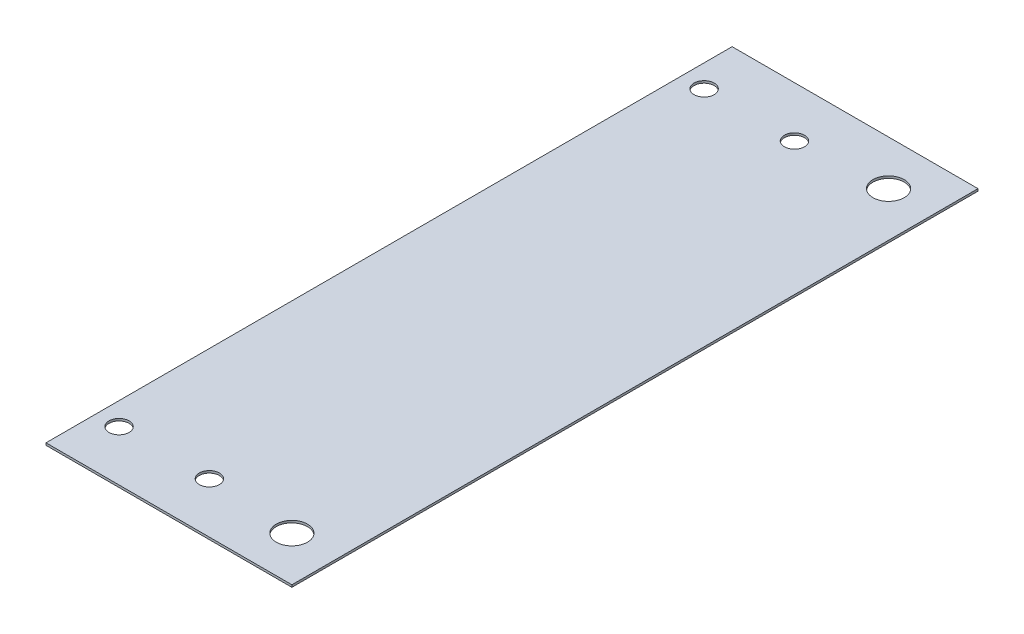
ISO-10303-21;
HEADER;
FILE_DESCRIPTION(('STEP AP214'),'2;1');
FILE_NAME('part.step','',(''),(''),'','','');
FILE_SCHEMA(('AUTOMOTIVE_DESIGN { 1 0 10303 214 1 1 1 1 }'));
ENDSEC;
DATA;
#1=APPLICATION_CONTEXT('core data for automotive mechanical design processes');
#2=APPLICATION_PROTOCOL_DEFINITION('international standard','automotive_design',2000,#1);
#3=PRODUCT_CONTEXT('',#1,'mechanical');
#4=PRODUCT('Part','Part','',(#3));
#5=PRODUCT_RELATED_PRODUCT_CATEGORY('part','',(#4));
#6=PRODUCT_DEFINITION_FORMATION('','',#4);
#7=PRODUCT_DEFINITION_CONTEXT('part definition',#1,'design');
#8=PRODUCT_DEFINITION('design','',#6,#7);
#9=PRODUCT_DEFINITION_SHAPE('','',#8);
#10=(LENGTH_UNIT() NAMED_UNIT(*) SI_UNIT(.MILLI.,.METRE.));
#11=(NAMED_UNIT(*) PLANE_ANGLE_UNIT() SI_UNIT($,.RADIAN.));
#12=(NAMED_UNIT(*) SI_UNIT($,.STERADIAN.) SOLID_ANGLE_UNIT());
#13=UNCERTAINTY_MEASURE_WITH_UNIT(LENGTH_MEASURE(1.E-05),#10,'distance_accuracy_value','');
#14=(GEOMETRIC_REPRESENTATION_CONTEXT(3) GLOBAL_UNCERTAINTY_ASSIGNED_CONTEXT((#13)) GLOBAL_UNIT_ASSIGNED_CONTEXT((#10,
#11,#12)) REPRESENTATION_CONTEXT('',''));
#15=CARTESIAN_POINT('',(0.,0.,0.));
#16=DIRECTION('',(0.,0.,1.));
#17=DIRECTION('',(1.,0.,0.));
#18=AXIS2_PLACEMENT_3D('',#15,#16,#17);
#19=CARTESIAN_POINT('',(13.75,0.25,38.3675));
#20=DIRECTION('',(0.,1.,0.));
#21=DIRECTION('',(0.,0.,1.));
#22=AXIS2_PLACEMENT_3D('',#19,#20,#21);
#23=PLANE('',#22);
#24=CARTESIAN_POINT('',(-11.23,0.25,32.7175));
#25=DIRECTION('',(0.,1.,0.));
#26=DIRECTION('',(0.,0.,1.));
#27=AXIS2_PLACEMENT_3D('',#24,#25,#26);
#28=CIRCLE('',#27,1.125);
#29=CARTESIAN_POINT('',(-11.23,0.25,33.8425));
#30=VERTEX_POINT('',#29);
#31=EDGE_CURVE('E133',#30,#30,#28,.T.);
#32=ORIENTED_EDGE('',*,*,#31,.F.);
#33=EDGE_LOOP('',(#32));
#34=FACE_BOUND('',#33,.T.);
#35=CARTESIAN_POINT('',(8.74999999999998,0.25,-33.3675));
#36=DIRECTION('',(0.,1.,0.));
#37=DIRECTION('',(0.,0.,1.));
#38=AXIS2_PLACEMENT_3D('',#35,#36,#37);
#39=CIRCLE('',#38,1.75);
#40=CARTESIAN_POINT('',(8.74999999999998,0.25,-31.6175));
#41=VERTEX_POINT('',#40);
#42=EDGE_CURVE('E121',#41,#41,#39,.T.);
#43=ORIENTED_EDGE('',*,*,#42,.F.);
#44=EDGE_LOOP('',(#43));
#45=FACE_BOUND('',#44,.T.);
#46=CARTESIAN_POINT('',(-11.23,0.25,-32.7175));
#47=DIRECTION('',(0.,1.,0.));
#48=DIRECTION('',(0.,0.,1.));
#49=AXIS2_PLACEMENT_3D('',#46,#47,#48);
#50=CIRCLE('',#49,1.125);
#51=CARTESIAN_POINT('',(-11.23,0.25,-31.5925));
#52=VERTEX_POINT('',#51);
#53=EDGE_CURVE('E100',#52,#52,#50,.T.);
#54=ORIENTED_EDGE('',*,*,#53,.F.);
#55=EDGE_LOOP('',(#54));
#56=FACE_BOUND('',#55,.T.);
#57=DIRECTION('',(0.,0.,-1.));
#58=VECTOR('',#57,1.);
#59=CARTESIAN_POINT('',(13.75,0.25,-38.3675));
#60=LINE('',#59,#58);
#61=CARTESIAN_POINT('',(13.75,0.25,38.3675));
#62=VERTEX_POINT('',#61);
#63=CARTESIAN_POINT('',(13.75,0.25,-38.3675));
#64=VERTEX_POINT('',#63);
#65=EDGE_CURVE('E85',#62,#64,#60,.T.);
#66=ORIENTED_EDGE('',*,*,#65,.T.);
#67=DIRECTION('',(-1.,0.,0.));
#68=VECTOR('',#67,1.);
#69=CARTESIAN_POINT('',(-13.75,0.25,-38.3675));
#70=LINE('',#69,#68);
#71=CARTESIAN_POINT('',(-13.75,0.25,-38.3675));
#72=VERTEX_POINT('',#71);
#73=EDGE_CURVE('E80',#64,#72,#70,.T.);
#74=ORIENTED_EDGE('',*,*,#73,.T.);
#75=DIRECTION('',(0.,0.,1.));
#76=VECTOR('',#75,1.);
#77=CARTESIAN_POINT('',(-13.75,0.25,-38.3675));
#78=LINE('',#77,#76);
#79=CARTESIAN_POINT('',(-13.75,0.25,38.3675));
#80=VERTEX_POINT('',#79);
#81=EDGE_CURVE('E83',#72,#80,#78,.T.);
#82=ORIENTED_EDGE('',*,*,#81,.T.);
#83=DIRECTION('',(1.,0.,0.));
#84=VECTOR('',#83,1.);
#85=CARTESIAN_POINT('',(-13.75,0.25,38.3675));
#86=LINE('',#85,#84);
#87=EDGE_CURVE('E50',#80,#62,#86,.T.);
#88=ORIENTED_EDGE('',*,*,#87,.T.);
#89=EDGE_LOOP('',(#66,#74,#82,#88));
#90=FACE_BOUND('',#89,.T.);
#91=CARTESIAN_POINT('',(-1.13000000000003,0.25,-32.7175));
#92=DIRECTION('',(0.,1.,0.));
#93=DIRECTION('',(0.,0.,1.));
#94=AXIS2_PLACEMENT_3D('',#91,#92,#93);
#95=CIRCLE('',#94,1.125);
#96=CARTESIAN_POINT('',(-1.13000000000003,0.25,-31.5925));
#97=VERTEX_POINT('',#96);
#98=EDGE_CURVE('E115',#97,#97,#95,.T.);
#99=ORIENTED_EDGE('',*,*,#98,.F.);
#100=EDGE_LOOP('',(#99));
#101=FACE_BOUND('',#100,.T.);
#102=CARTESIAN_POINT('',(8.74999999999997,0.25,33.3675));
#103=DIRECTION('',(0.,1.,0.));
#104=DIRECTION('',(0.,0.,1.));
#105=AXIS2_PLACEMENT_3D('',#102,#103,#104);
#106=CIRCLE('',#105,1.75);
#107=CARTESIAN_POINT('',(8.74999999999997,0.25,35.1175));
#108=VERTEX_POINT('',#107);
#109=EDGE_CURVE('E127',#108,#108,#106,.T.);
#110=ORIENTED_EDGE('',*,*,#109,.F.);
#111=EDGE_LOOP('',(#110));
#112=FACE_BOUND('',#111,.T.);
#113=CARTESIAN_POINT('',(-1.13000000000003,0.25,32.7175));
#114=DIRECTION('',(0.,1.,0.));
#115=DIRECTION('',(0.,0.,1.));
#116=AXIS2_PLACEMENT_3D('',#113,#114,#115);
#117=CIRCLE('',#116,1.125);
#118=CARTESIAN_POINT('',(-1.13000000000003,0.25,33.8425));
#119=VERTEX_POINT('',#118);
#120=EDGE_CURVE('E139',#119,#119,#117,.T.);
#121=ORIENTED_EDGE('',*,*,#120,.F.);
#122=EDGE_LOOP('',(#121));
#123=FACE_BOUND('',#122,.T.);
#124=ADVANCED_FACE('F33',(#34,#45,#56,#90,#101,#112,#123),#23,.T.);
#125=CARTESIAN_POINT('',(13.75,0.,38.3675));
#126=DIRECTION('',(0.,1.,0.));
#127=DIRECTION('',(0.,0.,1.));
#128=AXIS2_PLACEMENT_3D('',#125,#126,#127);
#129=PLANE('',#128);
#130=CARTESIAN_POINT('',(-11.23,0.,32.7175));
#131=DIRECTION('',(0.,1.,0.));
#132=DIRECTION('',(0.,0.,1.));
#133=AXIS2_PLACEMENT_3D('',#130,#131,#132);
#134=CIRCLE('',#133,1.125);
#135=CARTESIAN_POINT('',(-11.23,0.,33.8425));
#136=VERTEX_POINT('',#135);
#137=EDGE_CURVE('E136',#136,#136,#134,.T.);
#138=ORIENTED_EDGE('',*,*,#137,.T.);
#139=EDGE_LOOP('',(#138));
#140=FACE_BOUND('',#139,.T.);
#141=CARTESIAN_POINT('',(8.74999999999998,0.,-33.3675));
#142=DIRECTION('',(0.,1.,0.));
#143=DIRECTION('',(0.,0.,1.));
#144=AXIS2_PLACEMENT_3D('',#141,#142,#143);
#145=CIRCLE('',#144,1.75);
#146=CARTESIAN_POINT('',(8.74999999999998,0.,-31.6175));
#147=VERTEX_POINT('',#146);
#148=EDGE_CURVE('E124',#147,#147,#145,.T.);
#149=ORIENTED_EDGE('',*,*,#148,.T.);
#150=EDGE_LOOP('',(#149));
#151=FACE_BOUND('',#150,.T.);
#152=CARTESIAN_POINT('',(-11.23,0.,-32.7175));
#153=DIRECTION('',(0.,1.,0.));
#154=DIRECTION('',(0.,0.,1.));
#155=AXIS2_PLACEMENT_3D('',#152,#153,#154);
#156=CIRCLE('',#155,1.125);
#157=CARTESIAN_POINT('',(-11.23,0.,-31.5925));
#158=VERTEX_POINT('',#157);
#159=EDGE_CURVE('E112',#158,#158,#156,.T.);
#160=ORIENTED_EDGE('',*,*,#159,.T.);
#161=EDGE_LOOP('',(#160));
#162=FACE_BOUND('',#161,.T.);
#163=DIRECTION('',(0.,0.,-1.));
#164=VECTOR('',#163,1.);
#165=CARTESIAN_POINT('',(13.75,0.,-38.3675));
#166=LINE('',#165,#164);
#167=CARTESIAN_POINT('',(13.75,0.,38.3675));
#168=VERTEX_POINT('',#167);
#169=CARTESIAN_POINT('',(13.75,0.,-38.3675));
#170=VERTEX_POINT('',#169);
#171=EDGE_CURVE('E97',#168,#170,#166,.T.);
#172=ORIENTED_EDGE('',*,*,#171,.F.);
#173=DIRECTION('',(1.,0.,0.));
#174=VECTOR('',#173,1.);
#175=CARTESIAN_POINT('',(-13.75,0.,38.3675));
#176=LINE('',#175,#174);
#177=CARTESIAN_POINT('',(-13.75,0.,38.3675));
#178=VERTEX_POINT('',#177);
#179=EDGE_CURVE('E73',#178,#168,#176,.T.);
#180=ORIENTED_EDGE('',*,*,#179,.F.);
#181=DIRECTION('',(0.,0.,1.));
#182=VECTOR('',#181,1.);
#183=CARTESIAN_POINT('',(-13.75,0.,-38.3675));
#184=LINE('',#183,#182);
#185=CARTESIAN_POINT('',(-13.75,0.,-38.3675));
#186=VERTEX_POINT('',#185);
#187=EDGE_CURVE('E67',#186,#178,#184,.T.);
#188=ORIENTED_EDGE('',*,*,#187,.F.);
#189=DIRECTION('',(-1.,0.,0.));
#190=VECTOR('',#189,1.);
#191=CARTESIAN_POINT('',(-13.75,0.,-38.3675));
#192=LINE('',#191,#190);
#193=EDGE_CURVE('E89',#170,#186,#192,.T.);
#194=ORIENTED_EDGE('',*,*,#193,.F.);
#195=EDGE_LOOP('',(#172,#180,#188,#194));
#196=FACE_BOUND('',#195,.T.);
#197=CARTESIAN_POINT('',(-1.13000000000003,0.,-32.7175));
#198=DIRECTION('',(0.,1.,0.));
#199=DIRECTION('',(0.,0.,1.));
#200=AXIS2_PLACEMENT_3D('',#197,#198,#199);
#201=CIRCLE('',#200,1.125);
#202=CARTESIAN_POINT('',(-1.13000000000003,0.,-31.5925));
#203=VERTEX_POINT('',#202);
#204=EDGE_CURVE('E118',#203,#203,#201,.T.);
#205=ORIENTED_EDGE('',*,*,#204,.T.);
#206=EDGE_LOOP('',(#205));
#207=FACE_BOUND('',#206,.T.);
#208=CARTESIAN_POINT('',(8.74999999999997,0.,33.3675));
#209=DIRECTION('',(0.,1.,0.));
#210=DIRECTION('',(0.,0.,1.));
#211=AXIS2_PLACEMENT_3D('',#208,#209,#210);
#212=CIRCLE('',#211,1.75);
#213=CARTESIAN_POINT('',(8.74999999999997,0.,35.1175));
#214=VERTEX_POINT('',#213);
#215=EDGE_CURVE('E130',#214,#214,#212,.T.);
#216=ORIENTED_EDGE('',*,*,#215,.T.);
#217=EDGE_LOOP('',(#216));
#218=FACE_BOUND('',#217,.T.);
#219=CARTESIAN_POINT('',(-1.13000000000003,0.,32.7175));
#220=DIRECTION('',(0.,1.,0.));
#221=DIRECTION('',(0.,0.,1.));
#222=AXIS2_PLACEMENT_3D('',#219,#220,#221);
#223=CIRCLE('',#222,1.125);
#224=CARTESIAN_POINT('',(-1.13000000000003,0.,33.8425));
#225=VERTEX_POINT('',#224);
#226=EDGE_CURVE('E142',#225,#225,#223,.T.);
#227=ORIENTED_EDGE('',*,*,#226,.T.);
#228=EDGE_LOOP('',(#227));
#229=FACE_BOUND('',#228,.T.);
#230=ADVANCED_FACE('F108',(#140,#151,#162,#196,#207,#218,#229),#129,.F.);
#231=CARTESIAN_POINT('',(13.75,0.25,-38.3675));
#232=DIRECTION('',(-1.,0.,0.));
#233=DIRECTION('',(0.,0.,1.));
#234=AXIS2_PLACEMENT_3D('',#231,#232,#233);
#235=PLANE('',#234);
#236=ORIENTED_EDGE('',*,*,#171,.T.);
#237=DIRECTION('',(0.,-1.,0.));
#238=VECTOR('',#237,1.);
#239=CARTESIAN_POINT('',(13.75,0.25,-38.3675));
#240=LINE('',#239,#238);
#241=EDGE_CURVE('E11',#64,#170,#240,.T.);
#242=ORIENTED_EDGE('',*,*,#241,.F.);
#243=ORIENTED_EDGE('',*,*,#65,.F.);
#244=DIRECTION('',(0.,-1.,0.));
#245=VECTOR('',#244,1.);
#246=CARTESIAN_POINT('',(13.75,0.25,38.3675));
#247=LINE('',#246,#245);
#248=EDGE_CURVE('E93',#62,#168,#247,.T.);
#249=ORIENTED_EDGE('',*,*,#248,.T.);
#250=EDGE_LOOP('',(#236,#242,#243,#249));
#251=FACE_BOUND('',#250,.T.);
#252=ADVANCED_FACE('F35',(#251),#235,.F.);
#253=CARTESIAN_POINT('',(-13.75,0.25,-38.3675));
#254=DIRECTION('',(0.,0.,1.));
#255=DIRECTION('',(1.,0.,0.));
#256=AXIS2_PLACEMENT_3D('',#253,#254,#255);
#257=PLANE('',#256);
#258=ORIENTED_EDGE('',*,*,#193,.T.);
#259=DIRECTION('',(0.,-1.,0.));
#260=VECTOR('',#259,1.);
#261=CARTESIAN_POINT('',(-13.75,0.25,-38.3675));
#262=LINE('',#261,#260);
#263=EDGE_CURVE('E42',#72,#186,#262,.T.);
#264=ORIENTED_EDGE('',*,*,#263,.F.);
#265=ORIENTED_EDGE('',*,*,#73,.F.);
#266=ORIENTED_EDGE('',*,*,#241,.T.);
#267=EDGE_LOOP('',(#258,#264,#265,#266));
#268=FACE_BOUND('',#267,.T.);
#269=ADVANCED_FACE('F88',(#268),#257,.F.);
#270=CARTESIAN_POINT('',(-13.75,0.25,-38.3675));
#271=DIRECTION('',(1.,0.,0.));
#272=DIRECTION('',(0.,0.,-1.));
#273=AXIS2_PLACEMENT_3D('',#270,#271,#272);
#274=PLANE('',#273);
#275=ORIENTED_EDGE('',*,*,#187,.T.);
#276=DIRECTION('',(0.,-1.,0.));
#277=VECTOR('',#276,1.);
#278=CARTESIAN_POINT('',(-13.75,0.25,38.3675));
#279=LINE('',#278,#277);
#280=EDGE_CURVE('E90',#80,#178,#279,.T.);
#281=ORIENTED_EDGE('',*,*,#280,.F.);
#282=ORIENTED_EDGE('',*,*,#81,.F.);
#283=ORIENTED_EDGE('',*,*,#263,.T.);
#284=EDGE_LOOP('',(#275,#281,#282,#283));
#285=FACE_BOUND('',#284,.T.);
#286=ADVANCED_FACE('F91',(#285),#274,.F.);
#287=CARTESIAN_POINT('',(-13.75,0.25,38.3675));
#288=DIRECTION('',(0.,0.,-1.));
#289=DIRECTION('',(-1.,0.,0.));
#290=AXIS2_PLACEMENT_3D('',#287,#288,#289);
#291=PLANE('',#290);
#292=ORIENTED_EDGE('',*,*,#179,.T.);
#293=ORIENTED_EDGE('',*,*,#248,.F.);
#294=ORIENTED_EDGE('',*,*,#87,.F.);
#295=ORIENTED_EDGE('',*,*,#280,.T.);
#296=EDGE_LOOP('',(#292,#293,#294,#295));
#297=FACE_BOUND('',#296,.T.);
#298=ADVANCED_FACE('F105',(#297),#291,.F.);
#299=CARTESIAN_POINT('',(-11.23,0.25,-32.7175));
#300=DIRECTION('',(0.,-1.,0.));
#301=DIRECTION('',(0.,0.,-1.));
#302=AXIS2_PLACEMENT_3D('',#299,#300,#301);
#303=CYLINDRICAL_SURFACE('',#302,1.125);
#304=ORIENTED_EDGE('',*,*,#53,.T.);
#305=EDGE_LOOP('',(#304));
#306=FACE_BOUND('',#305,.T.);
#307=ORIENTED_EDGE('',*,*,#159,.F.);
#308=EDGE_LOOP('',(#307));
#309=FACE_BOUND('',#308,.T.);
#310=ADVANCED_FACE('F162',(#306,#309),#303,.F.);
#311=CARTESIAN_POINT('',(-1.13000000000003,0.25,-32.7175));
#312=DIRECTION('',(0.,-1.,0.));
#313=DIRECTION('',(0.,0.,-1.));
#314=AXIS2_PLACEMENT_3D('',#311,#312,#313);
#315=CYLINDRICAL_SURFACE('',#314,1.125);
#316=ORIENTED_EDGE('',*,*,#98,.T.);
#317=EDGE_LOOP('',(#316));
#318=FACE_BOUND('',#317,.T.);
#319=ORIENTED_EDGE('',*,*,#204,.F.);
#320=EDGE_LOOP('',(#319));
#321=FACE_BOUND('',#320,.T.);
#322=ADVANCED_FACE('F208',(#318,#321),#315,.F.);
#323=CARTESIAN_POINT('',(8.74999999999998,0.25,-33.3675));
#324=DIRECTION('',(0.,-1.,0.));
#325=DIRECTION('',(0.,0.,-1.));
#326=AXIS2_PLACEMENT_3D('',#323,#324,#325);
#327=CYLINDRICAL_SURFACE('',#326,1.75);
#328=ORIENTED_EDGE('',*,*,#42,.T.);
#329=EDGE_LOOP('',(#328));
#330=FACE_BOUND('',#329,.T.);
#331=ORIENTED_EDGE('',*,*,#148,.F.);
#332=EDGE_LOOP('',(#331));
#333=FACE_BOUND('',#332,.T.);
#334=ADVANCED_FACE('F216',(#330,#333),#327,.F.);
#335=CARTESIAN_POINT('',(8.74999999999997,0.25,33.3675));
#336=DIRECTION('',(0.,-1.,0.));
#337=DIRECTION('',(0.,0.,-1.));
#338=AXIS2_PLACEMENT_3D('',#335,#336,#337);
#339=CYLINDRICAL_SURFACE('',#338,1.75);
#340=ORIENTED_EDGE('',*,*,#109,.T.);
#341=EDGE_LOOP('',(#340));
#342=FACE_BOUND('',#341,.T.);
#343=ORIENTED_EDGE('',*,*,#215,.F.);
#344=EDGE_LOOP('',(#343));
#345=FACE_BOUND('',#344,.T.);
#346=ADVANCED_FACE('F224',(#342,#345),#339,.F.);
#347=CARTESIAN_POINT('',(-11.23,0.25,32.7175));
#348=DIRECTION('',(0.,-1.,0.));
#349=DIRECTION('',(0.,0.,-1.));
#350=AXIS2_PLACEMENT_3D('',#347,#348,#349);
#351=CYLINDRICAL_SURFACE('',#350,1.125);
#352=ORIENTED_EDGE('',*,*,#31,.T.);
#353=EDGE_LOOP('',(#352));
#354=FACE_BOUND('',#353,.T.);
#355=ORIENTED_EDGE('',*,*,#137,.F.);
#356=EDGE_LOOP('',(#355));
#357=FACE_BOUND('',#356,.T.);
#358=ADVANCED_FACE('F233',(#354,#357),#351,.F.);
#359=CARTESIAN_POINT('',(-1.13000000000003,0.25,32.7175));
#360=DIRECTION('',(0.,-1.,0.));
#361=DIRECTION('',(0.,0.,-1.));
#362=AXIS2_PLACEMENT_3D('',#359,#360,#361);
#363=CYLINDRICAL_SURFACE('',#362,1.125);
#364=ORIENTED_EDGE('',*,*,#120,.T.);
#365=EDGE_LOOP('',(#364));
#366=FACE_BOUND('',#365,.T.);
#367=ORIENTED_EDGE('',*,*,#226,.F.);
#368=EDGE_LOOP('',(#367));
#369=FACE_BOUND('',#368,.T.);
#370=ADVANCED_FACE('F148',(#366,#369),#363,.F.);
#371=CLOSED_SHELL('',(#124,#230,#252,#269,#286,#298,#310,#322,#334,#346,#358,#370));
#372=MANIFOLD_SOLID_BREP('B2',#371);
#373=ADVANCED_BREP_SHAPE_REPRESENTATION('',(#18,#372),#14);
#374=SHAPE_DEFINITION_REPRESENTATION(#9,#373);
ENDSEC;
END-ISO-10303-21;
